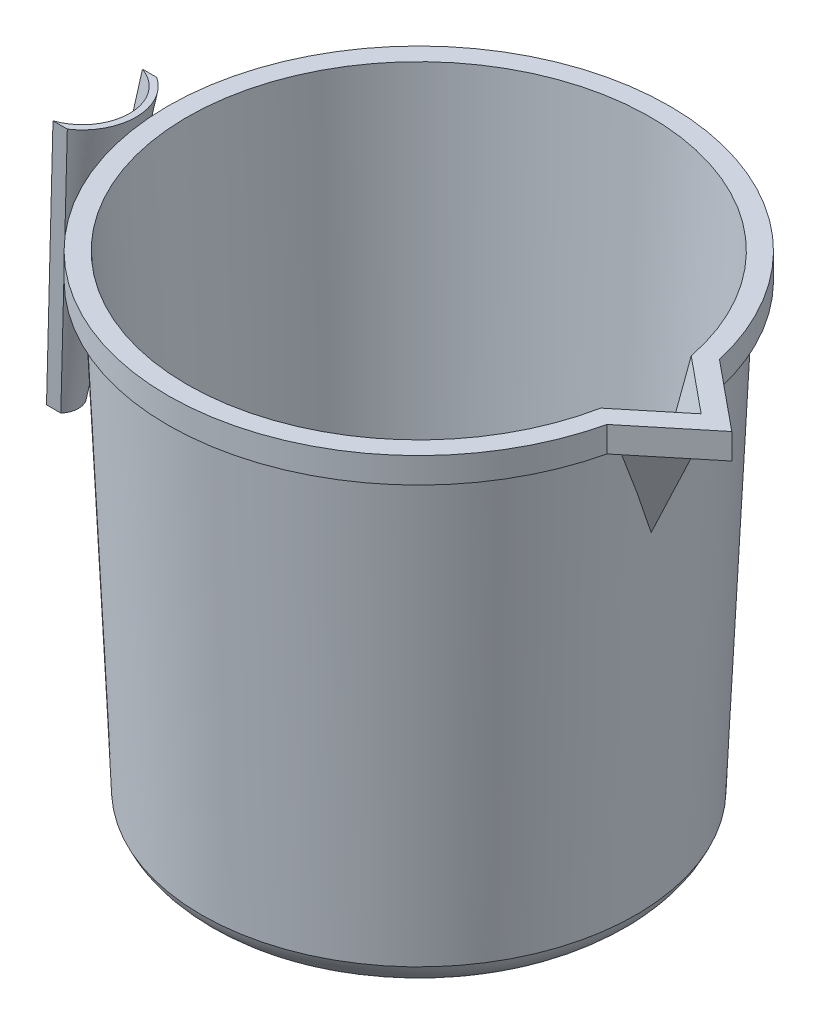
ISO-10303-21;
HEADER;
FILE_DESCRIPTION(('STEP AP214'),'2;1');
FILE_NAME('part.step','',(''),(''),'','','');
FILE_SCHEMA(('AUTOMOTIVE_DESIGN { 1 0 10303 214 1 1 1 1 }'));
ENDSEC;
DATA;
#1=APPLICATION_CONTEXT('core data for automotive mechanical design processes');
#2=APPLICATION_PROTOCOL_DEFINITION('international standard','automotive_design',2000,#1);
#3=PRODUCT_CONTEXT('',#1,'mechanical');
#4=PRODUCT('Part','Part','',(#3));
#5=PRODUCT_RELATED_PRODUCT_CATEGORY('part','',(#4));
#6=PRODUCT_DEFINITION_FORMATION('','',#4);
#7=PRODUCT_DEFINITION_CONTEXT('part definition',#1,'design');
#8=PRODUCT_DEFINITION('design','',#6,#7);
#9=PRODUCT_DEFINITION_SHAPE('','',#8);
#10=(LENGTH_UNIT() NAMED_UNIT(*) SI_UNIT(.MILLI.,.METRE.));
#11=(NAMED_UNIT(*) PLANE_ANGLE_UNIT() SI_UNIT($,.RADIAN.));
#12=(NAMED_UNIT(*) SI_UNIT($,.STERADIAN.) SOLID_ANGLE_UNIT());
#13=UNCERTAINTY_MEASURE_WITH_UNIT(LENGTH_MEASURE(1.E-05),#10,'distance_accuracy_value','');
#14=(GEOMETRIC_REPRESENTATION_CONTEXT(3) GLOBAL_UNCERTAINTY_ASSIGNED_CONTEXT((#13)) GLOBAL_UNIT_ASSIGNED_CONTEXT((#10,
#11,#12)) REPRESENTATION_CONTEXT('',''));
#15=CARTESIAN_POINT('',(0.,0.,0.));
#16=DIRECTION('',(0.,0.,1.));
#17=DIRECTION('',(1.,0.,0.));
#18=AXIS2_PLACEMENT_3D('',#15,#16,#17);
#19=CARTESIAN_POINT('',(-83.5632331264054,117.475,0.));
#20=DIRECTION('',(0.,-1.,0.));
#21=DIRECTION('',(0.,0.,-1.));
#22=AXIS2_PLACEMENT_3D('',#19,#20,#21);
#23=PLANE('',#22);
#24=CARTESIAN_POINT('',(-83.5632331264054,117.475,0.));
#25=DIRECTION('',(0.,1.,0.));
#26=DIRECTION('',(0.,0.,-1.));
#27=AXIS2_PLACEMENT_3D('',#24,#25,#26);
#28=CIRCLE('',#27,11.7475);
#29=CARTESIAN_POINT('',(-79.7532331264054,117.475,11.1125));
#30=VERTEX_POINT('',#29);
#31=CARTESIAN_POINT('',(-79.7532331264054,117.475,-11.1125));
#32=VERTEX_POINT('',#31);
#33=EDGE_CURVE('E140',#30,#32,#28,.T.);
#34=ORIENTED_EDGE('',*,*,#33,.F.);
#35=DIRECTION('',(-1.,0.,0.));
#36=VECTOR('',#35,1.);
#37=CARTESIAN_POINT('',(-79.7532331264054,117.475,11.1125));
#38=LINE('',#37,#36);
#39=CARTESIAN_POINT('',(-76.1920345298406,117.475,11.1125));
#40=VERTEX_POINT('',#39);
#41=EDGE_CURVE('E279',#40,#30,#38,.T.);
#42=ORIENTED_EDGE('',*,*,#41,.F.);
#43=CARTESIAN_POINT('',(-83.5632331264054,117.475,0.));
#44=DIRECTION('',(0.,-1.,0.));
#45=DIRECTION('',(0.,0.,-1.));
#46=AXIS2_PLACEMENT_3D('',#43,#44,#45);
#47=CIRCLE('',#46,13.335);
#48=CARTESIAN_POINT('',(-76.1920345298406,117.475,-11.1125));
#49=VERTEX_POINT('',#48);
#50=EDGE_CURVE('E97',#49,#40,#47,.T.);
#51=ORIENTED_EDGE('',*,*,#50,.F.);
#52=DIRECTION('',(1.,0.,0.));
#53=VECTOR('',#52,1.);
#54=CARTESIAN_POINT('',(-79.7532331264054,117.475,-11.1125));
#55=LINE('',#54,#53);
#56=EDGE_CURVE('E13',#32,#49,#55,.T.);
#57=ORIENTED_EDGE('',*,*,#56,.F.);
#58=EDGE_LOOP('',(#34,#42,#51,#57));
#59=FACE_BOUND('',#58,.T.);
#60=ADVANCED_FACE('F87',(#59),#23,.F.);
#61=CARTESIAN_POINT('',(-89.29624,47.625,0.));
#62=DIRECTION('',(0.,-1.,0.));
#63=DIRECTION('',(0.,0.,-1.));
#64=AXIS2_PLACEMENT_3D('',#61,#62,#63);
#65=PLANE('',#64);
#66=CARTESIAN_POINT('',(-89.29624,47.625,0.));
#67=DIRECTION('',(0.,-1.,0.));
#68=DIRECTION('',(0.,0.,-1.));
#69=AXIS2_PLACEMENT_3D('',#66,#67,#68);
#70=CIRCLE('',#69,3.175);
#71=CARTESIAN_POINT('',(-89.29624,47.625,-3.175));
#72=VERTEX_POINT('',#71);
#73=CARTESIAN_POINT('',(-89.29624,47.625,3.175));
#74=VERTEX_POINT('',#73);
#75=EDGE_CURVE('E137',#72,#74,#70,.T.);
#76=ORIENTED_EDGE('',*,*,#75,.F.);
#77=DIRECTION('',(-1.,0.,0.));
#78=VECTOR('',#77,1.);
#79=CARTESIAN_POINT('',(-89.29624,47.625,-3.175));
#80=LINE('',#79,#78);
#81=CARTESIAN_POINT('',(-85.7464820857191,47.625,-3.175));
#82=VERTEX_POINT('',#81);
#83=EDGE_CURVE('E145',#82,#72,#80,.T.);
#84=ORIENTED_EDGE('',*,*,#83,.F.);
#85=CARTESIAN_POINT('',(-89.29624,47.625,0.));
#86=DIRECTION('',(0.,1.,0.));
#87=DIRECTION('',(0.,0.,-1.));
#88=AXIS2_PLACEMENT_3D('',#85,#86,#87);
#89=CIRCLE('',#88,4.7625);
#90=CARTESIAN_POINT('',(-85.7464820857191,47.625,3.175));
#91=VERTEX_POINT('',#90);
#92=EDGE_CURVE('E151',#91,#82,#89,.T.);
#93=ORIENTED_EDGE('',*,*,#92,.F.);
#94=DIRECTION('',(1.,0.,0.));
#95=VECTOR('',#94,1.);
#96=CARTESIAN_POINT('',(-89.29624,47.625,3.175));
#97=LINE('',#96,#95);
#98=EDGE_CURVE('E157',#74,#91,#97,.T.);
#99=ORIENTED_EDGE('',*,*,#98,.F.);
#100=EDGE_LOOP('',(#76,#84,#93,#99));
#101=FACE_BOUND('',#100,.T.);
#102=ADVANCED_FACE('F155',(#101),#65,.T.);
#103=CARTESIAN_POINT('',(-85.7464820857191,47.625,3.175));
#104=CARTESIAN_POINT('',(-76.1920345298406,117.475,11.1125));
#105=CARTESIAN_POINT('',(-85.5700931968302,47.625,2.97779122698439));
#106=CARTESIAN_POINT('',(-75.4203331409517,117.475,10.6006112085719));
#107=CARTESIAN_POINT('',(-85.4046057407984,47.625,2.75877958825456));
#108=CARTESIAN_POINT('',(-74.6577564933924,117.475,9.97839340162191));
#109=CARTESIAN_POINT('',(-85.1079256249252,47.625,2.28339654460443));
#110=CARTESIAN_POINT('',(-73.2355419530008,117.475,8.49791997876269));
#111=CARTESIAN_POINT('',(-84.9767329650837,47.625,2.02702513968414));
#112=CARTESIAN_POINT('',(-72.5766385798861,117.475,7.63904068639852));
#113=CARTESIAN_POINT('',(-84.7611343720669,47.625,1.48316852889113));
#114=CARTESIAN_POINT('',(-71.4625982306742,117.475,5.71269091219484));
#115=CARTESIAN_POINT('',(-84.6773359549231,47.625,1.19598708103411));
#116=CARTESIAN_POINT('',(-71.0086802954942,117.475,4.64523798361919));
#117=CARTESIAN_POINT('',(-84.5636387688896,47.625,0.605995577303429));
#118=CARTESIAN_POINT('',(-70.3909940374061,117.475,2.38477464152053));
#119=CARTESIAN_POINT('',(-84.53374,47.625,0.303185521429773));
#120=CARTESIAN_POINT('',(-70.2282331264054,117.475,1.19276028068702));
#121=CARTESIAN_POINT('',(-84.53374,47.625,-0.303185521429769));
#122=CARTESIAN_POINT('',(-70.2282331264055,117.475,-1.19276028068703));
#123=CARTESIAN_POINT('',(-84.5636387688896,47.625,-0.605995577303424));
#124=CARTESIAN_POINT('',(-70.3909940374061,117.475,-2.38477464152053));
#125=CARTESIAN_POINT('',(-84.6773359549231,47.625,-1.1959870810341));
#126=CARTESIAN_POINT('',(-71.0086802954942,117.475,-4.6452379836192));
#127=CARTESIAN_POINT('',(-84.7611343720669,47.625,-1.48316852889113));
#128=CARTESIAN_POINT('',(-71.4625982306742,117.475,-5.71269091219484));
#129=CARTESIAN_POINT('',(-84.9767329650836,47.625,-2.02702513968414));
#130=CARTESIAN_POINT('',(-72.5766385798861,117.475,-7.63904068639853));
#131=CARTESIAN_POINT('',(-85.1079256249251,47.625,-2.28339654460443));
#132=CARTESIAN_POINT('',(-73.2355419530009,117.475,-8.49791997876269));
#133=CARTESIAN_POINT('',(-85.4046057407984,47.625,-2.75877958825455));
#134=CARTESIAN_POINT('',(-74.6577564933924,117.475,-9.97839340162191));
#135=CARTESIAN_POINT('',(-85.5700931968302,47.625,-2.97779122698439));
#136=CARTESIAN_POINT('',(-75.4203331409517,117.475,-10.6006112085719));
#137=CARTESIAN_POINT('',(-85.7464820857191,47.625,-3.175));
#138=CARTESIAN_POINT('',(-76.1920345298406,117.475,-11.1125));
#139=B_SPLINE_SURFACE_WITH_KNOTS('',3,1,((#103,#104),(#105,#106),(#107,#108),(#109,#110),(#111,
#112),(#113,#114),(#115,#116),(#117,#118),(#119,#120),(#121,#122),(#123,#124),(#125,#126),(#127,
#128),(#129,#130),(#131,#132),(#133,#134),(#135,#136),(#137,#138)),.UNSPECIFIED.,.F.,.F.,.F.,(4,
2,2,2,2,2,2,2,4),(2,2),(0.,0.125,0.25,0.375,0.5,0.625,0.75,0.875,1.),(0.,1.),.UNSPECIFIED.);
#140=DIRECTION('',(0.134672392057775,0.984553688763288,-0.111881100995828));
#141=VECTOR('',#140,1.);
#142=CARTESIAN_POINT('',(-80.9692583077798,82.55,-7.14375));
#143=LINE('',#142,#141);
#144=EDGE_CURVE('E105',#82,#49,#143,.T.);
#145=DIRECTION('',(-0.134672392057775,-0.984553688763288,-0.111881100995828));
#146=VECTOR('',#145,1.);
#147=CARTESIAN_POINT('',(-80.9692583077798,82.55,7.14375));
#148=LINE('',#147,#146);
#149=EDGE_CURVE('E150',#40,#91,#148,.T.);
#150=ORIENTED_EDGE('',*,*,#92,.T.);
#151=ORIENTED_EDGE('',*,*,#144,.T.);
#152=ORIENTED_EDGE('',*,*,#50,.T.);
#153=ORIENTED_EDGE('',*,*,#149,.T.);
#154=EDGE_LOOP('',(#150,#151,#152,#153));
#155=FACE_BOUND('',#154,.T.);
#156=ADVANCED_FACE('F178',(#155),#139,.T.);
#157=CARTESIAN_POINT('',(0.,0.250956144824069,2.20841407445181));
#158=DIRECTION('',(0.,-0.112909688044286,-0.993605254789719));
#159=DIRECTION('',(0.,0.993605254789719,-0.112909688044286));
#160=AXIS2_PLACEMENT_3D('',#157,#158,#159);
#161=PLANE('',#160);
#162=DIRECTION('',(0.134514052251797,0.98457505839026,-0.11188352936253));
#163=VECTOR('',#162,1.);
#164=CARTESIAN_POINT('',(-89.29624,47.625,-3.175));
#165=LINE('',#164,#163);
#166=EDGE_CURVE('E132',#72,#32,#165,.T.);
#167=ORIENTED_EDGE('',*,*,#166,.T.);
#168=ORIENTED_EDGE('',*,*,#56,.T.);
#169=ORIENTED_EDGE('',*,*,#144,.F.);
#170=ORIENTED_EDGE('',*,*,#83,.T.);
#171=EDGE_LOOP('',(#167,#168,#169,#170));
#172=FACE_BOUND('',#171,.T.);
#173=ADVANCED_FACE('F147',(#172),#161,.T.);
#174=CARTESIAN_POINT('',(0.,0.250956144824069,-2.20841407445181));
#175=DIRECTION('',(0.,-0.112909688044286,0.993605254789719));
#176=DIRECTION('',(0.,-0.993605254789719,-0.112909688044286));
#177=AXIS2_PLACEMENT_3D('',#174,#175,#176);
#178=PLANE('',#177);
#179=ORIENTED_EDGE('',*,*,#149,.F.);
#180=ORIENTED_EDGE('',*,*,#41,.T.);
#181=DIRECTION('',(0.134514052251797,0.98457505839026,0.11188352936253));
#182=VECTOR('',#181,1.);
#183=CARTESIAN_POINT('',(-84.5247365632027,82.55,7.14375));
#184=LINE('',#183,#182);
#185=EDGE_CURVE('E143',#74,#30,#184,.T.);
#186=ORIENTED_EDGE('',*,*,#185,.F.);
#187=ORIENTED_EDGE('',*,*,#98,.T.);
#188=EDGE_LOOP('',(#179,#180,#186,#187));
#189=FACE_BOUND('',#188,.T.);
#190=ADVANCED_FACE('F225',(#189),#178,.T.);
#191=CARTESIAN_POINT('',(-89.29624,47.625,-3.175));
#192=CARTESIAN_POINT('',(-79.7532331264054,117.475,-11.1125));
#193=CARTESIAN_POINT('',(-89.0316566666667,47.625,-3.175));
#194=CARTESIAN_POINT('',(-78.877247766045,117.475,-10.8121621621622));
#195=CARTESIAN_POINT('',(-88.73236,47.625,-3.14282666666667));
#196=CARTESIAN_POINT('',(-77.9596022046025,117.475,-10.3819021603716));
#197=CARTESIAN_POINT('',(-88.08212,47.625,-2.95317333333333));
#198=CARTESIAN_POINT('',(-76.1503080521726,117.475,-9.17785998036174));
#199=CARTESIAN_POINT('',(-87.7299066666667,47.625,-2.794));
#200=CARTESIAN_POINT('',(-75.259254791946,117.475,-8.40155146291025));
#201=CARTESIAN_POINT('',(-87.2219066666667,47.625,-2.413));
#202=CARTESIAN_POINT('',(-74.0806804384316,117.475,-6.96200707397473));
#203=CARTESIAN_POINT('',(-87.0566406380184,47.625,-2.26243823106274));
#204=CARTESIAN_POINT('',(-73.7147162001867,117.475,-6.43709209986744));
#205=CARTESIAN_POINT('',(-86.7515927866392,47.625,-1.91290423469069));
#206=CARTESIAN_POINT('',(-73.0624656134692,117.475,-5.3069126606205));
#207=CARTESIAN_POINT('',(-86.6119551095733,47.625,-1.71384083044983));
#208=CARTESIAN_POINT('',(-72.7763218091429,117.475,-4.70164932213463));
#209=CARTESIAN_POINT('',(-86.3775837139562,47.625,-1.27439446366782));
#210=CARTESIAN_POINT('',(-72.3072458033713,117.475,-3.43011829220404));
#211=CARTESIAN_POINT('',(-86.2830585404339,47.625,-1.03403550295858));
#212=CARTESIAN_POINT('',(-72.1244523114684,117.475,-2.76392925844789));
#213=CARTESIAN_POINT('',(-86.1548060749507,47.625,-0.529041420118344));
#214=CARTESIAN_POINT('',(-71.8786526632659,117.475,-1.39842442709464));
#215=CARTESIAN_POINT('',(-86.12124,47.625,-0.264583333333333));
#216=CARTESIAN_POINT('',(-71.8157331264054,117.475,-0.699255952380947));
#217=CARTESIAN_POINT('',(-86.12124,47.625,0.264583333333333));
#218=CARTESIAN_POINT('',(-71.8157331264054,117.475,0.699255952380957));
#219=CARTESIAN_POINT('',(-86.1548060749507,47.625,0.529041420118343));
#220=CARTESIAN_POINT('',(-71.8786526632659,117.475,1.39842442709465));
#221=CARTESIAN_POINT('',(-86.283058540434,47.625,1.03403550295858));
#222=CARTESIAN_POINT('',(-72.1244523114684,117.475,2.7639292584479));
#223=CARTESIAN_POINT('',(-86.3775837139562,47.625,1.27439446366782));
#224=CARTESIAN_POINT('',(-72.3072458033714,117.475,3.43011829220405));
#225=CARTESIAN_POINT('',(-86.6119551095732,47.625,1.71384083044983));
#226=CARTESIAN_POINT('',(-72.7763218091428,117.475,4.70164932213464));
#227=CARTESIAN_POINT('',(-86.7515927866391,47.625,1.91290423469069));
#228=CARTESIAN_POINT('',(-73.0624656134691,117.475,5.30691266062051));
#229=CARTESIAN_POINT('',(-87.0566406380184,47.625,2.26243823106274));
#230=CARTESIAN_POINT('',(-73.7147162001867,117.475,6.43709209986744));
#231=CARTESIAN_POINT('',(-87.2219066666667,47.625,2.413));
#232=CARTESIAN_POINT('',(-74.0806804384315,117.475,6.96200707397474));
#233=CARTESIAN_POINT('',(-87.7299066666667,47.625,2.794));
#234=CARTESIAN_POINT('',(-75.2592547919461,117.475,8.40155146291026));
#235=CARTESIAN_POINT('',(-88.0821200000001,47.625,2.95317333333333));
#236=CARTESIAN_POINT('',(-76.1503080521726,117.475,9.17785998036175));
#237=CARTESIAN_POINT('',(-88.7323600000001,47.625,3.14282666666667));
#238=CARTESIAN_POINT('',(-77.9596022046025,117.475,10.3819021603717));
#239=CARTESIAN_POINT('',(-89.0316566666667,47.625,3.175));
#240=CARTESIAN_POINT('',(-78.877247766045,117.475,10.8121621621622));
#241=CARTESIAN_POINT('',(-89.29624,47.625,3.175));
#242=CARTESIAN_POINT('',(-79.7532331264054,117.475,11.1125));
#243=B_SPLINE_SURFACE_WITH_KNOTS('',3,1,((#191,#192),(#193,#194),(#195,#196),(#197,#198),(#199,
#200),(#201,#202),(#203,#204),(#205,#206),(#207,#208),(#209,#210),(#211,#212),(#213,#214),(#215,
#216),(#217,#218),(#219,#220),(#221,#222),(#223,#224),(#225,#226),(#227,#228),(#229,#230),(#231,
#232),(#233,#234),(#235,#236),(#237,#238),(#239,#240),(#241,#242)),.UNSPECIFIED.,.F.,.F.,.F.,(4,
2,2,2,2,2,2,2,2,2,2,2,4),(2,2),(0.,0.125,0.249999999999999,0.312500000000003,0.375000000000002,
0.437500000000001,0.5,0.562499999999999,0.624999999999998,0.687499999999997,0.749999999999997,
0.874999999999998,1.),(0.,1.),.UNSPECIFIED.);
#244=ORIENTED_EDGE('',*,*,#75,.T.);
#245=ORIENTED_EDGE('',*,*,#185,.T.);
#246=ORIENTED_EDGE('',*,*,#33,.T.);
#247=ORIENTED_EDGE('',*,*,#166,.F.);
#248=EDGE_LOOP('',(#244,#245,#246,#247));
#249=FACE_BOUND('',#248,.T.);
#250=ADVANCED_FACE('F134',(#249),#243,.T.);
#251=CLOSED_SHELL('',(#60,#102,#156,#173,#190,#250));
#252=MANIFOLD_SOLID_BREP('B2',#251);
#253=CARTESIAN_POINT('',(0.,123.825,0.));
#254=DIRECTION('',(0.,1.,0.));
#255=DIRECTION('',(0.,0.,1.));
#256=AXIS2_PLACEMENT_3D('',#253,#254,#255);
#257=PLANE('',#256);
#258=CARTESIAN_POINT('',(0.,123.825,0.));
#259=DIRECTION('',(0.,1.,0.));
#260=DIRECTION('',(0.,0.,1.));
#261=AXIS2_PLACEMENT_3D('',#258,#259,#260);
#262=CIRCLE('',#261,62.3075342997989);
#263=CARTESIAN_POINT('',(60.7199457987493,123.825,-13.975586310333));
#264=VERTEX_POINT('',#263);
#265=CARTESIAN_POINT('',(60.7199457987493,123.825,13.9755863103331));
#266=VERTEX_POINT('',#265);
#267=EDGE_CURVE('E544',#264,#266,#262,.T.);
#268=ORIENTED_EDGE('',*,*,#267,.T.);
#269=DIRECTION('',(0.773106026896256,0.,-0.634276809584495));
#270=VECTOR('',#269,1.);
#271=CARTESIAN_POINT('',(60.7199457987493,123.825,13.9755863103331));
#272=LINE('',#271,#270);
#273=CARTESIAN_POINT('',(77.75448,123.825,0.));
#274=VERTEX_POINT('',#273);
#275=EDGE_CURVE('E547',#266,#274,#272,.T.);
#276=ORIENTED_EDGE('',*,*,#275,.T.);
#277=DIRECTION('',(-0.773106026896256,0.,-0.634276809584495));
#278=VECTOR('',#277,1.);
#279=CARTESIAN_POINT('',(77.75448,123.825,0.));
#280=LINE('',#279,#278);
#281=EDGE_CURVE('E550',#274,#264,#280,.T.);
#282=ORIENTED_EDGE('',*,*,#281,.T.);
#283=EDGE_LOOP('',(#268,#276,#282));
#284=FACE_BOUND('',#283,.T.);
#285=CARTESIAN_POINT('',(0.,123.825,0.));
#286=DIRECTION('',(0.,1.,0.));
#287=DIRECTION('',(0.,0.,1.));
#288=AXIS2_PLACEMENT_3D('',#285,#286,#287);
#289=CIRCLE('',#288,57.5446678903217);
#290=CARTESIAN_POINT('',(56.436064185918,123.825,11.2409724583938));
#291=VERTEX_POINT('',#290);
#292=CARTESIAN_POINT('',(56.436064185918,123.825,-11.2409724583938));
#293=VERTEX_POINT('',#292);
#294=EDGE_CURVE('E492',#291,#293,#289,.F.);
#295=ORIENTED_EDGE('',*,*,#294,.T.);
#296=DIRECTION('',(0.773106026896256,0.,0.634276809584495));
#297=VECTOR('',#296,1.);
#298=CARTESIAN_POINT('',(28.2167871893333,123.825,-34.3928201474259));
#299=LINE('',#298,#297);
#300=CARTESIAN_POINT('',(70.1374378203285,123.825,0.));
#301=VERTEX_POINT('',#300);
#302=EDGE_CURVE('E504',#293,#301,#299,.T.);
#303=ORIENTED_EDGE('',*,*,#302,.T.);
#304=DIRECTION('',(-0.773106026896256,0.,0.634276809584495));
#305=VECTOR('',#304,1.);
#306=CARTESIAN_POINT('',(28.2167871893333,123.825,34.3928201474259));
#307=LINE('',#306,#305);
#308=EDGE_CURVE('E499',#301,#291,#307,.T.);
#309=ORIENTED_EDGE('',*,*,#308,.T.);
#310=EDGE_LOOP('',(#295,#303,#309));
#311=FACE_BOUND('',#310,.T.);
#312=ADVANCED_FACE('F409',(#284,#311),#257,.T.);
#313=CARTESIAN_POINT('',(0.,123.825,0.));
#314=DIRECTION('',(0.,1.,0.));
#315=DIRECTION('',(0.,0.,1.));
#316=AXIS2_PLACEMENT_3D('',#313,#314,#315);
#317=CONICAL_SURFACE('',#316,59.13374,0.0444856998454232);
#318=CARTESIAN_POINT('',(0.,7.9375,0.));
#319=DIRECTION('',(0.,1.,0.));
#320=DIRECTION('',(0.,0.,1.));
#321=AXIS2_PLACEMENT_3D('',#318,#319,#320);
#322=CIRCLE('',#321,53.975);
#323=CARTESIAN_POINT('',(0.,7.9375,53.975));
#324=VERTEX_POINT('',#323);
#325=EDGE_CURVE('E575',#324,#324,#322,.T.);
#326=ORIENTED_EDGE('',*,*,#325,.T.);
#327=EDGE_LOOP('',(#326));
#328=FACE_BOUND('',#327,.T.);
#329=CARTESIAN_POINT('',(5.02778219497065,-3.45411496098283,6.12825293013599));
#330=DIRECTION('',(0.607482923836615,-0.287579420338054,0.740447549962147));
#331=DIRECTION('',(0.182404957234179,0.957756794284451,0.222329383074681));
#332=AXIS2_PLACEMENT_3D('',#329,#330,#331);
#333=ELLIPSE('',#332,185.923948997852,52.8770499448861);
#334=CARTESIAN_POINT('',(57.9230579940489,122.2375,11.548413983367));
#335=VERTEX_POINT('',#334);
#336=CARTESIAN_POINT('',(57.7203865753425,92.075,0.));
#337=VERTEX_POINT('',#336);
#338=EDGE_CURVE('E413',#335,#337,#333,.F.);
#339=ORIENTED_EDGE('',*,*,#338,.F.);
#340=CARTESIAN_POINT('',(0.,122.2375,0.));
#341=DIRECTION('',(0.,1.,0.));
#342=DIRECTION('',(0.,0.,1.));
#343=AXIS2_PLACEMENT_3D('',#340,#341,#342);
#344=CIRCLE('',#343,59.0630723287671);
#345=CARTESIAN_POINT('',(57.9230579940489,122.2375,-11.548413983367));
#346=VERTEX_POINT('',#345);
#347=EDGE_CURVE('E562',#335,#346,#344,.F.);
#348=ORIENTED_EDGE('',*,*,#347,.T.);
#349=CARTESIAN_POINT('',(5.0277821949706,-3.45411496098305,-6.12825293013594));
#350=DIRECTION('',(0.607482923836615,-0.287579420338054,-0.740447549962147));
#351=DIRECTION('',(0.182404957234179,0.957756794284451,-0.222329383074681));
#352=AXIS2_PLACEMENT_3D('',#349,#350,#351);
#353=ELLIPSE('',#352,185.923948997852,52.8770499448862);
#354=EDGE_CURVE('E568',#337,#346,#353,.F.);
#355=ORIENTED_EDGE('',*,*,#354,.F.);
#356=EDGE_LOOP('',(#339,#348,#355));
#357=FACE_BOUND('',#356,.T.);
#358=ADVANCED_FACE('F589',(#328,#357),#317,.T.);
#359=CARTESIAN_POINT('',(5.21540739649874,-2.46894814168521,6.35694515395231));
#360=DIRECTION('',(0.607482923836615,-0.287579420338054,0.740447549962147));
#361=DIRECTION('',(0.773106026896256,0.,-0.634276809584495));
#362=AXIS2_PLACEMENT_3D('',#359,#360,#361);
#363=PLANE('',#362);
#364=DIRECTION('',(-0.42787288720203,-0.903838919496942,0.));
#365=VECTOR('',#364,1.);
#366=CARTESIAN_POINT('',(72.75068,123.825,0.));
#367=LINE('',#366,#365);
#368=CARTESIAN_POINT('',(71.9991653287671,122.2375,0.));
#369=VERTEX_POINT('',#368);
#370=EDGE_CURVE('E565',#369,#337,#367,.T.);
#371=ORIENTED_EDGE('',*,*,#370,.F.);
#372=DIRECTION('',(-0.773106026896256,0.,0.634276809584495));
#373=VECTOR('',#372,1.);
#374=CARTESIAN_POINT('',(28.9657733305823,122.2375,35.3057428510648));
#375=LINE('',#374,#373);
#376=EDGE_CURVE('E556',#369,#335,#375,.T.);
#377=ORIENTED_EDGE('',*,*,#376,.T.);
#378=ORIENTED_EDGE('',*,*,#338,.T.);
#379=EDGE_LOOP('',(#371,#377,#378));
#380=FACE_BOUND('',#379,.T.);
#381=ADVANCED_FACE('F592',(#380),#363,.T.);
#382=CARTESIAN_POINT('',(5.21540739649874,-2.46894814168521,-6.35694515395231));
#383=DIRECTION('',(0.607482923836615,-0.287579420338054,-0.740447549962147));
#384=DIRECTION('',(-0.773106026896256,0.,-0.634276809584495));
#385=AXIS2_PLACEMENT_3D('',#382,#383,#384);
#386=PLANE('',#385);
#387=ORIENTED_EDGE('',*,*,#354,.T.);
#388=DIRECTION('',(0.773106026896256,0.,0.634276809584495));
#389=VECTOR('',#388,1.);
#390=CARTESIAN_POINT('',(28.9657733305823,122.2375,-35.3057428510648));
#391=LINE('',#390,#389);
#392=EDGE_CURVE('E85',#346,#369,#391,.T.);
#393=ORIENTED_EDGE('',*,*,#392,.T.);
#394=ORIENTED_EDGE('',*,*,#370,.T.);
#395=EDGE_LOOP('',(#387,#393,#394));
#396=FACE_BOUND('',#395,.T.);
#397=ADVANCED_FACE('F587',(#396),#386,.T.);
#398=CARTESIAN_POINT('',(0.,0.,0.));
#399=DIRECTION('',(0.,1.,0.));
#400=DIRECTION('',(0.,0.,1.));
#401=AXIS2_PLACEMENT_3D('',#398,#399,#400);
#402=PLANE('',#401);
#403=CARTESIAN_POINT('',(0.,0.,0.));
#404=DIRECTION('',(0.,1.,0.));
#405=DIRECTION('',(0.,0.,1.));
#406=AXIS2_PLACEMENT_3D('',#403,#404,#405);
#407=CIRCLE('',#406,42.07002);
#408=CARTESIAN_POINT('',(0.,0.,42.07002));
#409=VERTEX_POINT('',#408);
#410=EDGE_CURVE('E419',#409,#409,#407,.T.);
#411=ORIENTED_EDGE('',*,*,#410,.F.);
#412=EDGE_LOOP('',(#411));
#413=FACE_BOUND('',#412,.T.);
#414=ADVANCED_FACE('F411',(#413),#402,.F.);
#415=CARTESIAN_POINT('',(0.,12.8965326016,0.));
#416=DIRECTION('',(0.,1.,0.));
#417=DIRECTION('',(0.,0.,1.));
#418=AXIS2_PLACEMENT_3D('',#415,#416,#417);
#419=TOROIDAL_SURFACE('',#418,42.07002,12.8965326016);
#420=ORIENTED_EDGE('',*,*,#325,.F.);
#421=EDGE_LOOP('',(#420));
#422=FACE_BOUND('',#421,.T.);
#423=ORIENTED_EDGE('',*,*,#410,.T.);
#424=EDGE_LOOP('',(#423));
#425=FACE_BOUND('',#424,.T.);
#426=ADVANCED_FACE('F608',(#422,#425),#419,.T.);
#427=CARTESIAN_POINT('',(0.,122.2375,0.));
#428=DIRECTION('',(0.,1.,0.));
#429=DIRECTION('',(0.,0.,1.));
#430=AXIS2_PLACEMENT_3D('',#427,#428,#429);
#431=PLANE('',#430);
#432=DIRECTION('',(-0.773106026896256,0.,0.634276809584495));
#433=VECTOR('',#432,1.);
#434=CARTESIAN_POINT('',(75.2516295473089,122.2375,0.));
#435=LINE('',#434,#433);
#436=CARTESIAN_POINT('',(75.2516295473089,122.2375,0.));
#437=VERTEX_POINT('',#436);
#438=CARTESIAN_POINT('',(59.2913426060924,122.2375,13.0942451991599));
#439=VERTEX_POINT('',#438);
#440=EDGE_CURVE('E517',#437,#439,#435,.T.);
#441=ORIENTED_EDGE('',*,*,#440,.T.);
#442=CARTESIAN_POINT('',(0.,122.2375,0.));
#443=DIRECTION('',(0.,-1.,0.));
#444=DIRECTION('',(0.,0.,-1.));
#445=AXIS2_PLACEMENT_3D('',#442,#443,#444);
#446=CIRCLE('',#445,60.7200342997989);
#447=CARTESIAN_POINT('',(59.2913426060924,122.2375,-13.0942451991599));
#448=VERTEX_POINT('',#447);
#449=EDGE_CURVE('E510',#439,#448,#446,.T.);
#450=ORIENTED_EDGE('',*,*,#449,.T.);
#451=DIRECTION('',(0.773106026896256,0.,0.634276809584495));
#452=VECTOR('',#451,1.);
#453=CARTESIAN_POINT('',(59.2913426060924,122.2375,-13.0942451991599));
#454=LINE('',#453,#452);
#455=EDGE_CURVE('E524',#448,#437,#454,.T.);
#456=ORIENTED_EDGE('',*,*,#455,.T.);
#457=EDGE_LOOP('',(#441,#450,#456));
#458=FACE_BOUND('',#457,.T.);
#459=ORIENTED_EDGE('',*,*,#347,.F.);
#460=ORIENTED_EDGE('',*,*,#376,.F.);
#461=ORIENTED_EDGE('',*,*,#392,.F.);
#462=EDGE_LOOP('',(#459,#460,#461));
#463=FACE_BOUND('',#462,.T.);
#464=ADVANCED_FACE('F591',(#458,#463),#431,.F.);
#465=CARTESIAN_POINT('',(0.,117.475,0.));
#466=DIRECTION('',(0.,-1.,0.));
#467=DIRECTION('',(0.,0.,-1.));
#468=AXIS2_PLACEMENT_3D('',#465,#466,#467);
#469=PLANE('',#468);
#470=CARTESIAN_POINT('',(0.,117.475,0.));
#471=DIRECTION('',(0.,-1.,0.));
#472=DIRECTION('',(0.,0.,-1.));
#473=AXIS2_PLACEMENT_3D('',#470,#471,#472);
#474=CIRCLE('',#473,62.3075342997989);
#475=CARTESIAN_POINT('',(60.7199457987493,117.475,13.9755863103331));
#476=VERTEX_POINT('',#475);
#477=CARTESIAN_POINT('',(60.7199457987493,117.475,-13.975586310333));
#478=VERTEX_POINT('',#477);
#479=EDGE_CURVE('E535',#476,#478,#474,.T.);
#480=ORIENTED_EDGE('',*,*,#479,.T.);
#481=DIRECTION('',(0.773106026896256,0.,0.634276809584495));
#482=VECTOR('',#481,1.);
#483=CARTESIAN_POINT('',(77.75448,117.475,0.));
#484=LINE('',#483,#482);
#485=CARTESIAN_POINT('',(77.75448,117.475,0.));
#486=VERTEX_POINT('',#485);
#487=EDGE_CURVE('E538',#478,#486,#484,.T.);
#488=ORIENTED_EDGE('',*,*,#487,.T.);
#489=DIRECTION('',(-0.773106026896256,0.,0.634276809584495));
#490=VECTOR('',#489,1.);
#491=CARTESIAN_POINT('',(60.7199457987493,117.475,13.9755863103331));
#492=LINE('',#491,#490);
#493=EDGE_CURVE('E541',#486,#476,#492,.T.);
#494=ORIENTED_EDGE('',*,*,#493,.T.);
#495=EDGE_LOOP('',(#480,#488,#494));
#496=FACE_BOUND('',#495,.T.);
#497=DIRECTION('',(0.773106026896256,0.,0.634276809584495));
#498=VECTOR('',#497,1.);
#499=CARTESIAN_POINT('',(59.2913426060924,117.475,-13.0942451991599));
#500=LINE('',#499,#498);
#501=CARTESIAN_POINT('',(59.2913426060924,117.475,-13.0942451991599));
#502=VERTEX_POINT('',#501);
#503=CARTESIAN_POINT('',(75.2516295473089,117.475,0.));
#504=VERTEX_POINT('',#503);
#505=EDGE_CURVE('E516',#502,#504,#500,.T.);
#506=ORIENTED_EDGE('',*,*,#505,.F.);
#507=CARTESIAN_POINT('',(0.,117.475,0.));
#508=DIRECTION('',(0.,-1.,0.));
#509=DIRECTION('',(0.,0.,-1.));
#510=AXIS2_PLACEMENT_3D('',#507,#508,#509);
#511=CIRCLE('',#510,60.7200342997989);
#512=CARTESIAN_POINT('',(59.2913426060924,117.475,13.0942451991599));
#513=VERTEX_POINT('',#512);
#514=EDGE_CURVE('E514',#513,#502,#511,.T.);
#515=ORIENTED_EDGE('',*,*,#514,.F.);
#516=DIRECTION('',(-0.773106026896256,0.,0.634276809584495));
#517=VECTOR('',#516,1.);
#518=CARTESIAN_POINT('',(75.2516295473089,117.475,0.));
#519=LINE('',#518,#517);
#520=EDGE_CURVE('E520',#504,#513,#519,.T.);
#521=ORIENTED_EDGE('',*,*,#520,.F.);
#522=EDGE_LOOP('',(#506,#515,#521));
#523=FACE_BOUND('',#522,.T.);
#524=ADVANCED_FACE('F615',(#496,#523),#469,.T.);
#525=CARTESIAN_POINT('',(0.,117.475,0.));
#526=DIRECTION('',(0.,1.,0.));
#527=DIRECTION('',(0.,0.,1.));
#528=AXIS2_PLACEMENT_3D('',#525,#526,#527);
#529=CYLINDRICAL_SURFACE('',#528,60.7200342997989);
#530=ORIENTED_EDGE('',*,*,#449,.F.);
#531=DIRECTION('',(0.,1.,0.));
#532=VECTOR('',#531,1.);
#533=CARTESIAN_POINT('',(59.2913426060924,117.475,13.0942451991599));
#534=LINE('',#533,#532);
#535=EDGE_CURVE('E434',#513,#439,#534,.T.);
#536=ORIENTED_EDGE('',*,*,#535,.F.);
#537=ORIENTED_EDGE('',*,*,#514,.T.);
#538=DIRECTION('',(0.,1.,0.));
#539=VECTOR('',#538,1.);
#540=CARTESIAN_POINT('',(59.2913426060924,117.475,-13.0942451991599));
#541=LINE('',#540,#539);
#542=EDGE_CURVE('E532',#502,#448,#541,.T.);
#543=ORIENTED_EDGE('',*,*,#542,.T.);
#544=EDGE_LOOP('',(#530,#536,#537,#543));
#545=FACE_BOUND('',#544,.T.);
#546=ADVANCED_FACE('F647',(#545),#529,.F.);
#547=CARTESIAN_POINT('',(59.2913426060924,117.475,-13.0942451991599));
#548=DIRECTION('',(-0.634276809584495,0.,0.773106026896256));
#549=DIRECTION('',(0.773106026896256,0.,0.634276809584495));
#550=AXIS2_PLACEMENT_3D('',#547,#548,#549);
#551=PLANE('',#550);
#552=ORIENTED_EDGE('',*,*,#455,.F.);
#553=ORIENTED_EDGE('',*,*,#542,.F.);
#554=ORIENTED_EDGE('',*,*,#505,.T.);
#555=DIRECTION('',(0.,1.,0.));
#556=VECTOR('',#555,1.);
#557=CARTESIAN_POINT('',(75.2516295473089,117.475,0.));
#558=LINE('',#557,#556);
#559=EDGE_CURVE('E530',#504,#437,#558,.T.);
#560=ORIENTED_EDGE('',*,*,#559,.T.);
#561=EDGE_LOOP('',(#552,#553,#554,#560));
#562=FACE_BOUND('',#561,.T.);
#563=ADVANCED_FACE('F657',(#562),#551,.T.);
#564=CARTESIAN_POINT('',(75.2516295473089,117.475,0.));
#565=DIRECTION('',(-0.634276809584495,0.,-0.773106026896256));
#566=DIRECTION('',(-0.773106026896256,0.,0.634276809584495));
#567=AXIS2_PLACEMENT_3D('',#564,#565,#566);
#568=PLANE('',#567);
#569=ORIENTED_EDGE('',*,*,#440,.F.);
#570=ORIENTED_EDGE('',*,*,#559,.F.);
#571=ORIENTED_EDGE('',*,*,#520,.T.);
#572=ORIENTED_EDGE('',*,*,#535,.T.);
#573=EDGE_LOOP('',(#569,#570,#571,#572));
#574=FACE_BOUND('',#573,.T.);
#575=ADVANCED_FACE('F667',(#574),#568,.T.);
#576=CARTESIAN_POINT('',(60.7199457987493,122.2375,13.9755863103331));
#577=DIRECTION('',(0.634276809584495,0.,0.773106026896256));
#578=DIRECTION('',(0.773106026896256,0.,-0.634276809584495));
#579=AXIS2_PLACEMENT_3D('',#576,#577,#578);
#580=PLANE('',#579);
#581=ORIENTED_EDGE('',*,*,#275,.F.);
#582=DIRECTION('',(0.,1.,0.));
#583=VECTOR('',#582,1.);
#584=CARTESIAN_POINT('',(60.7199457987493,122.2375,13.9755863103331));
#585=LINE('',#584,#583);
#586=EDGE_CURVE('E553',#476,#266,#585,.T.);
#587=ORIENTED_EDGE('',*,*,#586,.F.);
#588=ORIENTED_EDGE('',*,*,#493,.F.);
#589=DIRECTION('',(0.,1.,0.));
#590=VECTOR('',#589,1.);
#591=CARTESIAN_POINT('',(77.75448,122.2375,0.));
#592=LINE('',#591,#590);
#593=EDGE_CURVE('E557',#486,#274,#592,.T.);
#594=ORIENTED_EDGE('',*,*,#593,.T.);
#595=EDGE_LOOP('',(#581,#587,#588,#594));
#596=FACE_BOUND('',#595,.T.);
#597=ADVANCED_FACE('F677',(#596),#580,.T.);
#598=CARTESIAN_POINT('',(77.75448,122.2375,0.));
#599=DIRECTION('',(0.634276809584495,0.,-0.773106026896256));
#600=DIRECTION('',(-0.773106026896256,0.,-0.634276809584495));
#601=AXIS2_PLACEMENT_3D('',#598,#599,#600);
#602=PLANE('',#601);
#603=ORIENTED_EDGE('',*,*,#281,.F.);
#604=ORIENTED_EDGE('',*,*,#593,.F.);
#605=ORIENTED_EDGE('',*,*,#487,.F.);
#606=DIRECTION('',(0.,1.,0.));
#607=VECTOR('',#606,1.);
#608=CARTESIAN_POINT('',(60.7199457987493,122.2375,-13.975586310333));
#609=LINE('',#608,#607);
#610=EDGE_CURVE('E554',#478,#264,#609,.T.);
#611=ORIENTED_EDGE('',*,*,#610,.T.);
#612=EDGE_LOOP('',(#603,#604,#605,#611));
#613=FACE_BOUND('',#612,.T.);
#614=ADVANCED_FACE('F686',(#613),#602,.T.);
#615=CARTESIAN_POINT('',(0.,122.2375,0.));
#616=DIRECTION('',(0.,1.,0.));
#617=DIRECTION('',(0.,0.,1.));
#618=AXIS2_PLACEMENT_3D('',#615,#616,#617);
#619=CYLINDRICAL_SURFACE('',#618,62.3075342997989);
#620=ORIENTED_EDGE('',*,*,#267,.F.);
#621=ORIENTED_EDGE('',*,*,#610,.F.);
#622=ORIENTED_EDGE('',*,*,#479,.F.);
#623=ORIENTED_EDGE('',*,*,#586,.T.);
#624=EDGE_LOOP('',(#620,#621,#622,#623));
#625=FACE_BOUND('',#624,.T.);
#626=ADVANCED_FACE('F696',(#625),#619,.T.);
#627=CARTESIAN_POINT('',(0.,123.895597757898,0.));
#628=DIRECTION('',(0.,1.,0.));
#629=DIRECTION('',(0.,0.,1.));
#630=AXIS2_PLACEMENT_3D('',#627,#628,#629);
#631=CONICAL_SURFACE('',#630,57.54781055435,0.0444856998454232);
#632=CARTESIAN_POINT('',(0.,8.29819205662901,0.));
#633=DIRECTION('',(0.,1.,0.));
#634=DIRECTION('',(0.,0.,1.));
#635=AXIS2_PLACEMENT_3D('',#632,#633,#634);
#636=CIRCLE('',#635,52.4019841219275);
#637=CARTESIAN_POINT('',(0.,8.29819205662901,52.4019841219275));
#638=VERTEX_POINT('',#637);
#639=EDGE_CURVE('E494',#638,#638,#636,.T.);
#640=ORIENTED_EDGE('',*,*,#639,.F.);
#641=EDGE_LOOP('',(#640));
#642=FACE_BOUND('',#641,.T.);
#643=CARTESIAN_POINT('',(4.89862431392598,1.38792776911448,5.97082523492796));
#644=DIRECTION('',(0.607482923836615,-0.287579420338054,0.740447549962147));
#645=DIRECTION('',(0.182404957234179,0.957756794284451,0.222329383074681));
#646=AXIS2_PLACEMENT_3D('',#643,#644,#645);
#647=ELLIPSE('',#646,181.147778838364,51.5186999881982);
#648=CARTESIAN_POINT('',(56.2376169297902,94.4630107955446,0.));
#649=VERTEX_POINT('',#648);
#650=EDGE_CURVE('E426',#291,#649,#647,.F.);
#651=ORIENTED_EDGE('',*,*,#650,.T.);
#652=CARTESIAN_POINT('',(4.89862431392594,1.38792776911428,-5.97082523492793));
#653=DIRECTION('',(0.607482923836615,-0.287579420338054,-0.740447549962147));
#654=DIRECTION('',(0.182404957234179,0.957756794284451,-0.222329383074681));
#655=AXIS2_PLACEMENT_3D('',#652,#653,#654);
#656=ELLIPSE('',#655,181.147778838365,51.5186999881982);
#657=EDGE_CURVE('E490',#649,#293,#656,.F.);
#658=ORIENTED_EDGE('',*,*,#657,.T.);
#659=ORIENTED_EDGE('',*,*,#294,.F.);
#660=EDGE_LOOP('',(#651,#658,#659));
#661=FACE_BOUND('',#660,.T.);
#662=ADVANCED_FACE('F488',(#642,#661),#631,.F.);
#663=CARTESIAN_POINT('',(4.25102825490812,-2.01241581189855,5.1814846683874));
#664=DIRECTION('',(0.607482923836615,-0.287579420338054,0.740447549962147));
#665=DIRECTION('',(0.773106026896256,0.,-0.634276809584495));
#666=AXIS2_PLACEMENT_3D('',#663,#664,#665);
#667=PLANE('',#666);
#668=DIRECTION('',(-0.42787288720203,-0.903838919496942,0.));
#669=VECTOR('',#668,1.);
#670=CARTESIAN_POINT('',(9.410396421777,-4.45483525863482,0.));
#671=LINE('',#670,#669);
#672=EDGE_CURVE('E497',#301,#649,#671,.T.);
#673=ORIENTED_EDGE('',*,*,#672,.T.);
#674=ORIENTED_EDGE('',*,*,#650,.F.);
#675=ORIENTED_EDGE('',*,*,#308,.F.);
#676=EDGE_LOOP('',(#673,#674,#675));
#677=FACE_BOUND('',#676,.T.);
#678=ADVANCED_FACE('F498',(#677),#667,.F.);
#679=CARTESIAN_POINT('',(4.25102825490811,-2.01241581189855,-5.1814846683874));
#680=DIRECTION('',(0.607482923836615,-0.287579420338054,-0.740447549962147));
#681=DIRECTION('',(-0.773106026896256,0.,-0.634276809584495));
#682=AXIS2_PLACEMENT_3D('',#679,#680,#681);
#683=PLANE('',#682);
#684=ORIENTED_EDGE('',*,*,#657,.F.);
#685=ORIENTED_EDGE('',*,*,#672,.F.);
#686=ORIENTED_EDGE('',*,*,#302,.F.);
#687=EDGE_LOOP('',(#684,#685,#686));
#688=FACE_BOUND('',#687,.T.);
#689=ADVANCED_FACE('F503',(#688),#683,.F.);
#690=CARTESIAN_POINT('',(0.,1.5875,0.));
#691=DIRECTION('',(0.,1.,0.));
#692=DIRECTION('',(0.,0.,1.));
#693=AXIS2_PLACEMENT_3D('',#690,#691,#692);
#694=PLANE('',#693);
#695=CARTESIAN_POINT('',(0.,1.5875,0.));
#696=DIRECTION('',(0.,1.,0.));
#697=DIRECTION('',(0.,0.,1.));
#698=AXIS2_PLACEMENT_3D('',#695,#696,#697);
#699=CIRCLE('',#698,42.07002);
#700=CARTESIAN_POINT('',(0.,1.5875,42.07002));
#701=VERTEX_POINT('',#700);
#702=EDGE_CURVE('E511',#701,#701,#699,.T.);
#703=ORIENTED_EDGE('',*,*,#702,.T.);
#704=EDGE_LOOP('',(#703));
#705=FACE_BOUND('',#704,.T.);
#706=ADVANCED_FACE('F739',(#705),#694,.T.);
#707=CARTESIAN_POINT('',(0.,12.8965326016,0.));
#708=DIRECTION('',(0.,1.,0.));
#709=DIRECTION('',(0.,0.,1.));
#710=AXIS2_PLACEMENT_3D('',#707,#708,#709);
#711=TOROIDAL_SURFACE('',#710,42.07002,11.3090326016);
#712=ORIENTED_EDGE('',*,*,#639,.T.);
#713=EDGE_LOOP('',(#712));
#714=FACE_BOUND('',#713,.T.);
#715=ORIENTED_EDGE('',*,*,#702,.F.);
#716=EDGE_LOOP('',(#715));
#717=FACE_BOUND('',#716,.T.);
#718=ADVANCED_FACE('F748',(#714,#717),#711,.F.);
#719=CLOSED_SHELL('',(#312,#358,#381,#397,#414,#426,#464,#524,#546,#563,#575,#597,#614,#626,
#662,#678,#689,#706,#718));
#720=MANIFOLD_SOLID_BREP('B7',#719);
#721=ADVANCED_BREP_SHAPE_REPRESENTATION('',(#18,#252,#720),#14);
#722=SHAPE_DEFINITION_REPRESENTATION(#9,#721);
ENDSEC;
END-ISO-10303-21;
